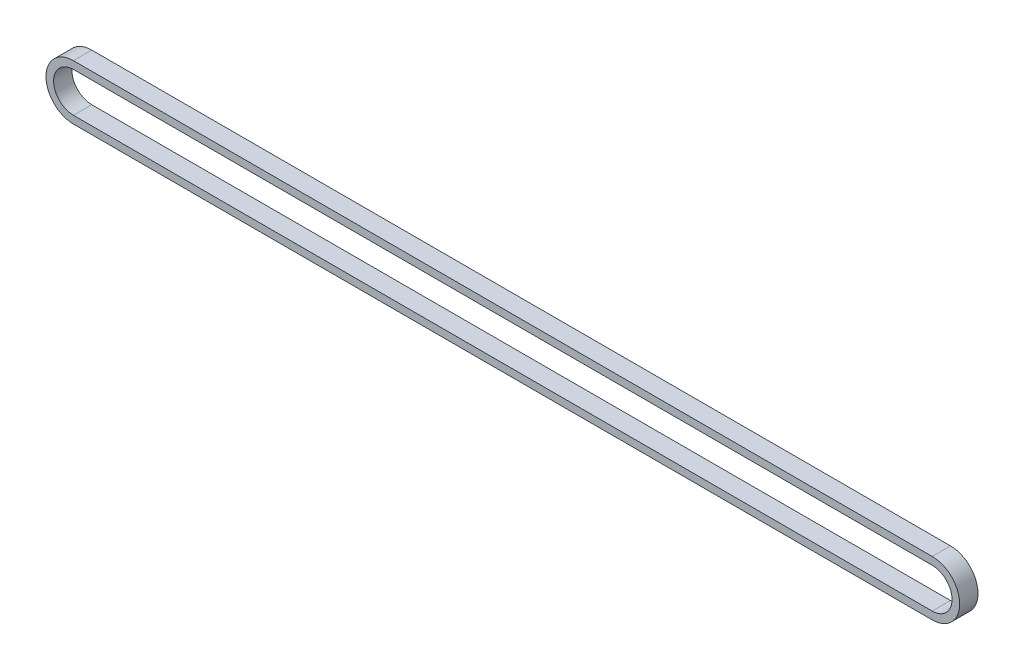
ISO-10303-21;
HEADER;
FILE_DESCRIPTION(('STEP AP214'),'2;1');
FILE_NAME('part.step','',(''),(''),'','','');
FILE_SCHEMA(('AUTOMOTIVE_DESIGN { 1 0 10303 214 1 1 1 1 }'));
ENDSEC;
DATA;
#1=APPLICATION_CONTEXT('core data for automotive mechanical design processes');
#2=APPLICATION_PROTOCOL_DEFINITION('international standard','automotive_design',2000,#1);
#3=PRODUCT_CONTEXT('',#1,'mechanical');
#4=PRODUCT('Part','Part','',(#3));
#5=PRODUCT_RELATED_PRODUCT_CATEGORY('part','',(#4));
#6=PRODUCT_DEFINITION_FORMATION('','',#4);
#7=PRODUCT_DEFINITION_CONTEXT('part definition',#1,'design');
#8=PRODUCT_DEFINITION('design','',#6,#7);
#9=PRODUCT_DEFINITION_SHAPE('','',#8);
#10=(LENGTH_UNIT() NAMED_UNIT(*) SI_UNIT(.MILLI.,.METRE.));
#11=(NAMED_UNIT(*) PLANE_ANGLE_UNIT() SI_UNIT($,.RADIAN.));
#12=(NAMED_UNIT(*) SI_UNIT($,.STERADIAN.) SOLID_ANGLE_UNIT());
#13=UNCERTAINTY_MEASURE_WITH_UNIT(LENGTH_MEASURE(1.E-05),#10,'distance_accuracy_value','');
#14=(GEOMETRIC_REPRESENTATION_CONTEXT(3) GLOBAL_UNCERTAINTY_ASSIGNED_CONTEXT((#13)) GLOBAL_UNIT_ASSIGNED_CONTEXT((#10,
#11,#12)) REPRESENTATION_CONTEXT('',''));
#15=CARTESIAN_POINT('',(0.,0.,0.));
#16=DIRECTION('',(0.,0.,1.));
#17=DIRECTION('',(1.,0.,0.));
#18=AXIS2_PLACEMENT_3D('',#15,#16,#17);
#19=CARTESIAN_POINT('',(-140.6652,0.,6.));
#20=DIRECTION('',(0.,0.,1.));
#21=DIRECTION('',(1.,0.,0.));
#22=AXIS2_PLACEMENT_3D('',#19,#20,#21);
#23=PLANE('',#22);
#24=CARTESIAN_POINT('',(-140.6652,0.,6.));
#25=DIRECTION('',(0.,0.,1.));
#26=DIRECTION('',(1.,0.,0.));
#27=AXIS2_PLACEMENT_3D('',#24,#25,#26);
#28=CIRCLE('',#27,9.);
#29=CARTESIAN_POINT('',(-140.6652,9.,6.));
#30=VERTEX_POINT('',#29);
#31=CARTESIAN_POINT('',(-140.6652,-9.,6.));
#32=VERTEX_POINT('',#31);
#33=EDGE_CURVE('E138',#30,#32,#28,.T.);
#34=ORIENTED_EDGE('',*,*,#33,.T.);
#35=DIRECTION('',(1.,0.,0.));
#36=VECTOR('',#35,1.);
#37=CARTESIAN_POINT('',(-140.6652,-9.,6.));
#38=LINE('',#37,#36);
#39=CARTESIAN_POINT('',(140.6652,-8.99999999999992,6.));
#40=VERTEX_POINT('',#39);
#41=EDGE_CURVE('E141',#32,#40,#38,.T.);
#42=ORIENTED_EDGE('',*,*,#41,.T.);
#43=CARTESIAN_POINT('',(140.6652,0.,6.));
#44=DIRECTION('',(0.,0.,1.));
#45=DIRECTION('',(1.,0.,0.));
#46=AXIS2_PLACEMENT_3D('',#43,#44,#45);
#47=CIRCLE('',#46,8.99999999999997);
#48=CARTESIAN_POINT('',(140.6652,9.,6.));
#49=VERTEX_POINT('',#48);
#50=EDGE_CURVE('E144',#40,#49,#47,.T.);
#51=ORIENTED_EDGE('',*,*,#50,.T.);
#52=DIRECTION('',(-1.,0.,0.));
#53=VECTOR('',#52,1.);
#54=CARTESIAN_POINT('',(-140.6652,9.,6.));
#55=LINE('',#54,#53);
#56=EDGE_CURVE('E146',#49,#30,#55,.T.);
#57=ORIENTED_EDGE('',*,*,#56,.T.);
#58=EDGE_LOOP('',(#34,#42,#51,#57));
#59=FACE_BOUND('',#58,.T.);
#60=DIRECTION('',(1.,0.,0.));
#61=VECTOR('',#60,1.);
#62=CARTESIAN_POINT('',(-140.6652,-6.5,6.));
#63=LINE('',#62,#61);
#64=CARTESIAN_POINT('',(-140.6652,-6.5,6.));
#65=VERTEX_POINT('',#64);
#66=CARTESIAN_POINT('',(140.6652,-6.49999999999995,6.));
#67=VERTEX_POINT('',#66);
#68=EDGE_CURVE('E110',#65,#67,#63,.T.);
#69=ORIENTED_EDGE('',*,*,#68,.F.);
#70=CARTESIAN_POINT('',(-140.6652,0.,6.));
#71=DIRECTION('',(0.,0.,1.));
#72=DIRECTION('',(1.,0.,0.));
#73=AXIS2_PLACEMENT_3D('',#70,#71,#72);
#74=CIRCLE('',#73,6.5);
#75=CARTESIAN_POINT('',(-140.6652,6.5,6.));
#76=VERTEX_POINT('',#75);
#77=EDGE_CURVE('E102',#76,#65,#74,.T.);
#78=ORIENTED_EDGE('',*,*,#77,.F.);
#79=DIRECTION('',(-1.,0.,0.));
#80=VECTOR('',#79,1.);
#81=CARTESIAN_POINT('',(-140.6652,6.5,6.));
#82=LINE('',#81,#80);
#83=CARTESIAN_POINT('',(140.6652,6.50000000000005,6.));
#84=VERTEX_POINT('',#83);
#85=EDGE_CURVE('E124',#84,#76,#82,.T.);
#86=ORIENTED_EDGE('',*,*,#85,.F.);
#87=CARTESIAN_POINT('',(140.6652,0.,6.));
#88=DIRECTION('',(0.,0.,1.));
#89=DIRECTION('',(1.,0.,0.));
#90=AXIS2_PLACEMENT_3D('',#87,#88,#89);
#91=CIRCLE('',#90,6.5);
#92=EDGE_CURVE('E122',#67,#84,#91,.T.);
#93=ORIENTED_EDGE('',*,*,#92,.F.);
#94=EDGE_LOOP('',(#69,#78,#86,#93));
#95=FACE_BOUND('',#94,.T.);
#96=ADVANCED_FACE('F37',(#59,#95),#23,.T.);
#97=CARTESIAN_POINT('',(-140.6652,0.,0.));
#98=DIRECTION('',(0.,0.,1.));
#99=DIRECTION('',(1.,0.,0.));
#100=AXIS2_PLACEMENT_3D('',#97,#98,#99);
#101=PLANE('',#100);
#102=CARTESIAN_POINT('',(-140.6652,0.,0.));
#103=DIRECTION('',(0.,0.,1.));
#104=DIRECTION('',(1.,0.,0.));
#105=AXIS2_PLACEMENT_3D('',#102,#103,#104);
#106=CIRCLE('',#105,9.);
#107=CARTESIAN_POINT('',(-140.6652,9.,0.));
#108=VERTEX_POINT('',#107);
#109=CARTESIAN_POINT('',(-140.6652,-9.,0.));
#110=VERTEX_POINT('',#109);
#111=EDGE_CURVE('E118',#108,#110,#106,.T.);
#112=ORIENTED_EDGE('',*,*,#111,.F.);
#113=DIRECTION('',(-1.,0.,0.));
#114=VECTOR('',#113,1.);
#115=CARTESIAN_POINT('',(-140.6652,9.,0.));
#116=LINE('',#115,#114);
#117=CARTESIAN_POINT('',(140.6652,9.,0.));
#118=VERTEX_POINT('',#117);
#119=EDGE_CURVE('E142',#118,#108,#116,.T.);
#120=ORIENTED_EDGE('',*,*,#119,.F.);
#121=CARTESIAN_POINT('',(140.6652,0.,0.));
#122=DIRECTION('',(0.,0.,1.));
#123=DIRECTION('',(1.,0.,0.));
#124=AXIS2_PLACEMENT_3D('',#121,#122,#123);
#125=CIRCLE('',#124,8.99999999999997);
#126=CARTESIAN_POINT('',(140.6652,-8.99999999999992,0.));
#127=VERTEX_POINT('',#126);
#128=EDGE_CURVE('E153',#127,#118,#125,.T.);
#129=ORIENTED_EDGE('',*,*,#128,.F.);
#130=DIRECTION('',(1.,0.,0.));
#131=VECTOR('',#130,1.);
#132=CARTESIAN_POINT('',(-140.6652,-9.,0.));
#133=LINE('',#132,#131);
#134=EDGE_CURVE('E151',#110,#127,#133,.T.);
#135=ORIENTED_EDGE('',*,*,#134,.F.);
#136=EDGE_LOOP('',(#112,#120,#129,#135));
#137=FACE_BOUND('',#136,.T.);
#138=CARTESIAN_POINT('',(-140.6652,0.,0.));
#139=DIRECTION('',(0.,0.,1.));
#140=DIRECTION('',(1.,0.,0.));
#141=AXIS2_PLACEMENT_3D('',#138,#139,#140);
#142=CIRCLE('',#141,6.5);
#143=CARTESIAN_POINT('',(-140.6652,6.5,0.));
#144=VERTEX_POINT('',#143);
#145=CARTESIAN_POINT('',(-140.6652,-6.5,0.));
#146=VERTEX_POINT('',#145);
#147=EDGE_CURVE('E60',#144,#146,#142,.T.);
#148=ORIENTED_EDGE('',*,*,#147,.T.);
#149=DIRECTION('',(1.,0.,0.));
#150=VECTOR('',#149,1.);
#151=CARTESIAN_POINT('',(-140.6652,-6.5,0.));
#152=LINE('',#151,#150);
#153=CARTESIAN_POINT('',(140.6652,-6.49999999999995,0.));
#154=VERTEX_POINT('',#153);
#155=EDGE_CURVE('E117',#146,#154,#152,.T.);
#156=ORIENTED_EDGE('',*,*,#155,.T.);
#157=CARTESIAN_POINT('',(140.6652,0.,0.));
#158=DIRECTION('',(0.,0.,1.));
#159=DIRECTION('',(1.,0.,0.));
#160=AXIS2_PLACEMENT_3D('',#157,#158,#159);
#161=CIRCLE('',#160,6.5);
#162=CARTESIAN_POINT('',(140.6652,6.50000000000005,0.));
#163=VERTEX_POINT('',#162);
#164=EDGE_CURVE('E130',#154,#163,#161,.T.);
#165=ORIENTED_EDGE('',*,*,#164,.T.);
#166=DIRECTION('',(-1.,0.,0.));
#167=VECTOR('',#166,1.);
#168=CARTESIAN_POINT('',(-140.6652,6.5,0.));
#169=LINE('',#168,#167);
#170=EDGE_CURVE('E111',#163,#144,#169,.T.);
#171=ORIENTED_EDGE('',*,*,#170,.T.);
#172=EDGE_LOOP('',(#148,#156,#165,#171));
#173=FACE_BOUND('',#172,.T.);
#174=ADVANCED_FACE('F171',(#137,#173),#101,.F.);
#175=CARTESIAN_POINT('',(-140.6652,0.,6.));
#176=DIRECTION('',(0.,0.,-1.));
#177=DIRECTION('',(-1.,0.,0.));
#178=AXIS2_PLACEMENT_3D('',#175,#176,#177);
#179=CYLINDRICAL_SURFACE('',#178,9.);
#180=ORIENTED_EDGE('',*,*,#111,.T.);
#181=DIRECTION('',(0.,0.,-1.));
#182=VECTOR('',#181,1.);
#183=CARTESIAN_POINT('',(-140.6652,-9.,6.));
#184=LINE('',#183,#182);
#185=EDGE_CURVE('E11',#32,#110,#184,.T.);
#186=ORIENTED_EDGE('',*,*,#185,.F.);
#187=ORIENTED_EDGE('',*,*,#33,.F.);
#188=DIRECTION('',(0.,0.,-1.));
#189=VECTOR('',#188,1.);
#190=CARTESIAN_POINT('',(-140.6652,9.,6.));
#191=LINE('',#190,#189);
#192=EDGE_CURVE('E148',#30,#108,#191,.T.);
#193=ORIENTED_EDGE('',*,*,#192,.T.);
#194=EDGE_LOOP('',(#180,#186,#187,#193));
#195=FACE_BOUND('',#194,.T.);
#196=ADVANCED_FACE('F39',(#195),#179,.T.);
#197=CARTESIAN_POINT('',(-140.6652,-9.,6.));
#198=DIRECTION('',(0.,1.,0.));
#199=DIRECTION('',(-1.,0.,0.));
#200=AXIS2_PLACEMENT_3D('',#197,#198,#199);
#201=PLANE('',#200);
#202=ORIENTED_EDGE('',*,*,#134,.T.);
#203=DIRECTION('',(0.,0.,-1.));
#204=VECTOR('',#203,1.);
#205=CARTESIAN_POINT('',(140.6652,-8.99999999999992,6.));
#206=LINE('',#205,#204);
#207=EDGE_CURVE('E45',#40,#127,#206,.T.);
#208=ORIENTED_EDGE('',*,*,#207,.F.);
#209=ORIENTED_EDGE('',*,*,#41,.F.);
#210=ORIENTED_EDGE('',*,*,#185,.T.);
#211=EDGE_LOOP('',(#202,#208,#209,#210));
#212=FACE_BOUND('',#211,.T.);
#213=ADVANCED_FACE('F181',(#212),#201,.F.);
#214=CARTESIAN_POINT('',(140.6652,0.,6.));
#215=DIRECTION('',(0.,0.,-1.));
#216=DIRECTION('',(-1.,0.,0.));
#217=AXIS2_PLACEMENT_3D('',#214,#215,#216);
#218=CYLINDRICAL_SURFACE('',#217,8.99999999999997);
#219=ORIENTED_EDGE('',*,*,#128,.T.);
#220=DIRECTION('',(0.,0.,-1.));
#221=VECTOR('',#220,1.);
#222=CARTESIAN_POINT('',(140.6652,9.,6.));
#223=LINE('',#222,#221);
#224=EDGE_CURVE('E158',#49,#118,#223,.T.);
#225=ORIENTED_EDGE('',*,*,#224,.F.);
#226=ORIENTED_EDGE('',*,*,#50,.F.);
#227=ORIENTED_EDGE('',*,*,#207,.T.);
#228=EDGE_LOOP('',(#219,#225,#226,#227));
#229=FACE_BOUND('',#228,.T.);
#230=ADVANCED_FACE('F165',(#229),#218,.T.);
#231=CARTESIAN_POINT('',(-140.6652,9.,6.));
#232=DIRECTION('',(0.,-1.,0.));
#233=DIRECTION('',(0.,0.,-1.));
#234=AXIS2_PLACEMENT_3D('',#231,#232,#233);
#235=PLANE('',#234);
#236=ORIENTED_EDGE('',*,*,#119,.T.);
#237=ORIENTED_EDGE('',*,*,#192,.F.);
#238=ORIENTED_EDGE('',*,*,#56,.F.);
#239=ORIENTED_EDGE('',*,*,#224,.T.);
#240=EDGE_LOOP('',(#236,#237,#238,#239));
#241=FACE_BOUND('',#240,.T.);
#242=ADVANCED_FACE('F175',(#241),#235,.F.);
#243=CARTESIAN_POINT('',(-140.6652,0.,6.));
#244=DIRECTION('',(0.,0.,-1.));
#245=DIRECTION('',(-1.,0.,0.));
#246=AXIS2_PLACEMENT_3D('',#243,#244,#245);
#247=CYLINDRICAL_SURFACE('',#246,6.5);
#248=ORIENTED_EDGE('',*,*,#147,.F.);
#249=DIRECTION('',(0.,0.,-1.));
#250=VECTOR('',#249,1.);
#251=CARTESIAN_POINT('',(-140.6652,6.5,6.));
#252=LINE('',#251,#250);
#253=EDGE_CURVE('E106',#76,#144,#252,.T.);
#254=ORIENTED_EDGE('',*,*,#253,.F.);
#255=ORIENTED_EDGE('',*,*,#77,.T.);
#256=DIRECTION('',(0.,0.,-1.));
#257=VECTOR('',#256,1.);
#258=CARTESIAN_POINT('',(-140.6652,-6.5,6.));
#259=LINE('',#258,#257);
#260=EDGE_CURVE('E105',#65,#146,#259,.T.);
#261=ORIENTED_EDGE('',*,*,#260,.T.);
#262=EDGE_LOOP('',(#248,#254,#255,#261));
#263=FACE_BOUND('',#262,.T.);
#264=ADVANCED_FACE('F104',(#263),#247,.F.);
#265=CARTESIAN_POINT('',(-140.6652,-6.5,6.));
#266=DIRECTION('',(0.,1.,0.));
#267=DIRECTION('',(-1.,0.,0.));
#268=AXIS2_PLACEMENT_3D('',#265,#266,#267);
#269=PLANE('',#268);
#270=ORIENTED_EDGE('',*,*,#155,.F.);
#271=ORIENTED_EDGE('',*,*,#260,.F.);
#272=ORIENTED_EDGE('',*,*,#68,.T.);
#273=DIRECTION('',(0.,0.,-1.));
#274=VECTOR('',#273,1.);
#275=CARTESIAN_POINT('',(140.6652,-6.49999999999995,6.));
#276=LINE('',#275,#274);
#277=EDGE_CURVE('E119',#67,#154,#276,.T.);
#278=ORIENTED_EDGE('',*,*,#277,.T.);
#279=EDGE_LOOP('',(#270,#271,#272,#278));
#280=FACE_BOUND('',#279,.T.);
#281=ADVANCED_FACE('F114',(#280),#269,.T.);
#282=CARTESIAN_POINT('',(140.6652,0.,6.));
#283=DIRECTION('',(0.,0.,-1.));
#284=DIRECTION('',(-1.,0.,0.));
#285=AXIS2_PLACEMENT_3D('',#282,#283,#284);
#286=CYLINDRICAL_SURFACE('',#285,6.5);
#287=ORIENTED_EDGE('',*,*,#164,.F.);
#288=ORIENTED_EDGE('',*,*,#277,.F.);
#289=ORIENTED_EDGE('',*,*,#92,.T.);
#290=DIRECTION('',(0.,0.,-1.));
#291=VECTOR('',#290,1.);
#292=CARTESIAN_POINT('',(140.6652,6.50000000000005,6.));
#293=LINE('',#292,#291);
#294=EDGE_CURVE('E52',#84,#163,#293,.T.);
#295=ORIENTED_EDGE('',*,*,#294,.T.);
#296=EDGE_LOOP('',(#287,#288,#289,#295));
#297=FACE_BOUND('',#296,.T.);
#298=ADVANCED_FACE('F204',(#297),#286,.F.);
#299=CARTESIAN_POINT('',(-140.6652,6.5,6.));
#300=DIRECTION('',(0.,-1.,0.));
#301=DIRECTION('',(1.,0.,0.));
#302=AXIS2_PLACEMENT_3D('',#299,#300,#301);
#303=PLANE('',#302);
#304=ORIENTED_EDGE('',*,*,#170,.F.);
#305=ORIENTED_EDGE('',*,*,#294,.F.);
#306=ORIENTED_EDGE('',*,*,#85,.T.);
#307=ORIENTED_EDGE('',*,*,#253,.T.);
#308=EDGE_LOOP('',(#304,#305,#306,#307));
#309=FACE_BOUND('',#308,.T.);
#310=ADVANCED_FACE('F208',(#309),#303,.T.);
#311=CLOSED_SHELL('',(#96,#174,#196,#213,#230,#242,#264,#281,#298,#310));
#312=MANIFOLD_SOLID_BREP('B2',#311);
#313=ADVANCED_BREP_SHAPE_REPRESENTATION('',(#18,#312),#14);
#314=SHAPE_DEFINITION_REPRESENTATION(#9,#313);
ENDSEC;
END-ISO-10303-21;
